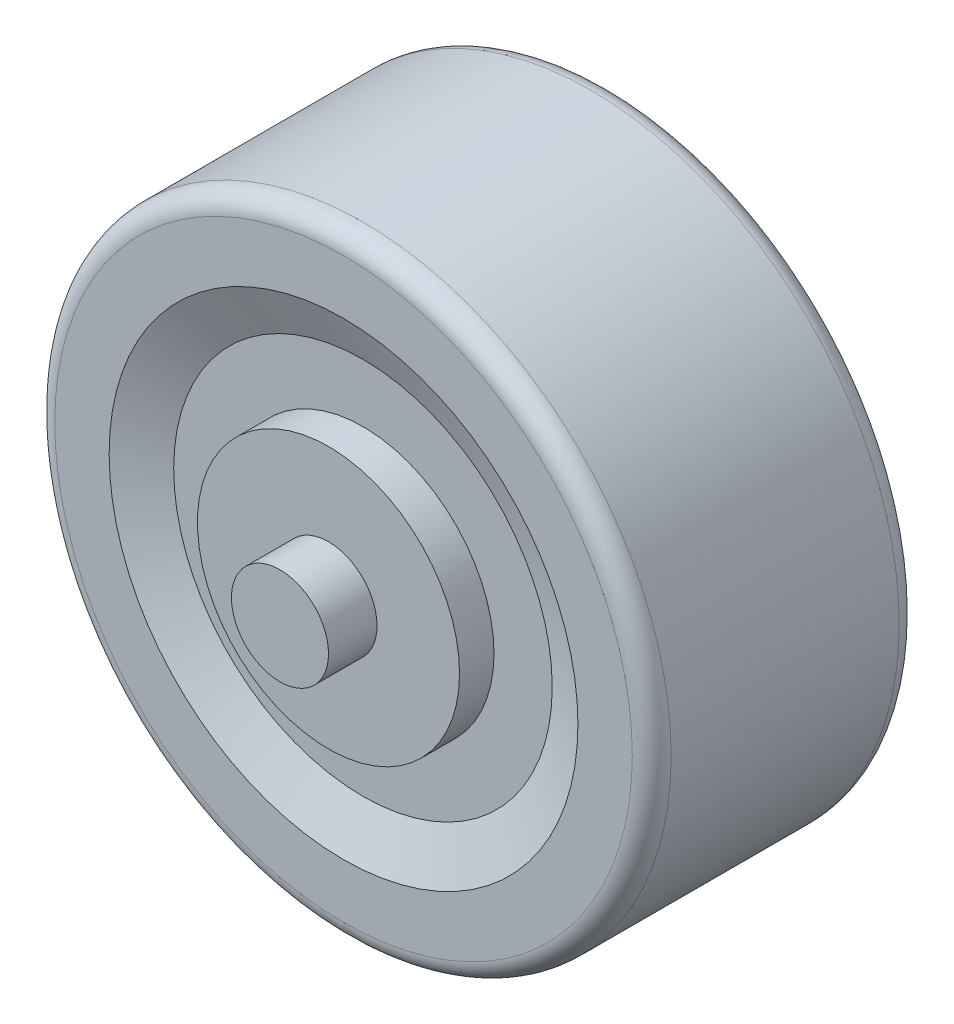
ISO-10303-21;
HEADER;
FILE_DESCRIPTION(('STEP AP214'),'2;1');
FILE_NAME('part.step','',(''),(''),'','','');
FILE_SCHEMA(('AUTOMOTIVE_DESIGN { 1 0 10303 214 1 1 1 1 }'));
ENDSEC;
DATA;
#1=APPLICATION_CONTEXT('core data for automotive mechanical design processes');
#2=APPLICATION_PROTOCOL_DEFINITION('international standard','automotive_design',2000,#1);
#3=PRODUCT_CONTEXT('',#1,'mechanical');
#4=PRODUCT('Part','Part','',(#3));
#5=PRODUCT_RELATED_PRODUCT_CATEGORY('part','',(#4));
#6=PRODUCT_DEFINITION_FORMATION('','',#4);
#7=PRODUCT_DEFINITION_CONTEXT('part definition',#1,'design');
#8=PRODUCT_DEFINITION('design','',#6,#7);
#9=PRODUCT_DEFINITION_SHAPE('','',#8);
#10=(LENGTH_UNIT() NAMED_UNIT(*) SI_UNIT(.MILLI.,.METRE.));
#11=(NAMED_UNIT(*) PLANE_ANGLE_UNIT() SI_UNIT($,.RADIAN.));
#12=(NAMED_UNIT(*) SI_UNIT($,.STERADIAN.) SOLID_ANGLE_UNIT());
#13=UNCERTAINTY_MEASURE_WITH_UNIT(LENGTH_MEASURE(1.E-05),#10,'distance_accuracy_value','');
#14=(GEOMETRIC_REPRESENTATION_CONTEXT(3) GLOBAL_UNCERTAINTY_ASSIGNED_CONTEXT((#13)) GLOBAL_UNIT_ASSIGNED_CONTEXT((#10,
#11,#12)) REPRESENTATION_CONTEXT('',''));
#15=CARTESIAN_POINT('',(0.,0.,0.));
#16=DIRECTION('',(0.,0.,1.));
#17=DIRECTION('',(1.,0.,0.));
#18=AXIS2_PLACEMENT_3D('',#15,#16,#17);
#19=CARTESIAN_POINT('',(2.5,0.,-10.15));
#20=DIRECTION('',(0.,0.,-1.));
#21=DIRECTION('',(-1.,0.,0.));
#22=AXIS2_PLACEMENT_3D('',#19,#20,#21);
#23=PLANE('',#22);
#24=CARTESIAN_POINT('',(0.,0.,-10.15));
#25=DIRECTION('',(0.,0.,1.));
#26=DIRECTION('',(1.,0.,0.));
#27=AXIS2_PLACEMENT_3D('',#24,#25,#26);
#28=CIRCLE('',#27,2.5);
#29=CARTESIAN_POINT('',(2.5,0.,-10.15));
#30=VERTEX_POINT('',#29);
#31=EDGE_CURVE('E56',#30,#30,#28,.T.);
#32=ORIENTED_EDGE('',*,*,#31,.F.);
#33=EDGE_LOOP('',(#32));
#34=FACE_BOUND('',#33,.T.);
#35=ADVANCED_FACE('F36',(#34),#23,.T.);
#36=CARTESIAN_POINT('',(0.,0.,0.));
#37=DIRECTION('',(0.,0.,1.));
#38=DIRECTION('',(1.,0.,0.));
#39=AXIS2_PLACEMENT_3D('',#36,#37,#38);
#40=CYLINDRICAL_SURFACE('',#39,2.5);
#41=ORIENTED_EDGE('',*,*,#31,.T.);
#42=EDGE_LOOP('',(#41));
#43=FACE_BOUND('',#42,.T.);
#44=CARTESIAN_POINT('',(0.,0.,-7.65));
#45=DIRECTION('',(0.,0.,1.));
#46=DIRECTION('',(1.,0.,0.));
#47=AXIS2_PLACEMENT_3D('',#44,#45,#46);
#48=CIRCLE('',#47,2.5);
#49=CARTESIAN_POINT('',(2.5,0.,-7.65));
#50=VERTEX_POINT('',#49);
#51=EDGE_CURVE('E59',#50,#50,#48,.T.);
#52=ORIENTED_EDGE('',*,*,#51,.F.);
#53=EDGE_LOOP('',(#52));
#54=FACE_BOUND('',#53,.T.);
#55=ADVANCED_FACE('F108',(#43,#54),#40,.T.);
#56=CARTESIAN_POINT('',(6.75,0.,-7.65));
#57=DIRECTION('',(0.,0.,-1.));
#58=DIRECTION('',(-1.,0.,0.));
#59=AXIS2_PLACEMENT_3D('',#56,#57,#58);
#60=PLANE('',#59);
#61=ORIENTED_EDGE('',*,*,#51,.T.);
#62=EDGE_LOOP('',(#61));
#63=FACE_BOUND('',#62,.T.);
#64=CARTESIAN_POINT('',(0.,0.,-7.65));
#65=DIRECTION('',(0.,0.,1.));
#66=DIRECTION('',(1.,0.,0.));
#67=AXIS2_PLACEMENT_3D('',#64,#65,#66);
#68=CIRCLE('',#67,6.75);
#69=CARTESIAN_POINT('',(6.75,0.,-7.65));
#70=VERTEX_POINT('',#69);
#71=EDGE_CURVE('E62',#70,#70,#68,.T.);
#72=ORIENTED_EDGE('',*,*,#71,.F.);
#73=EDGE_LOOP('',(#72));
#74=FACE_BOUND('',#73,.T.);
#75=ADVANCED_FACE('F114',(#63,#74),#60,.T.);
#76=CARTESIAN_POINT('',(0.,0.,0.));
#77=DIRECTION('',(0.,0.,1.));
#78=DIRECTION('',(1.,0.,0.));
#79=AXIS2_PLACEMENT_3D('',#76,#77,#78);
#80=CYLINDRICAL_SURFACE('',#79,6.75);
#81=ORIENTED_EDGE('',*,*,#71,.T.);
#82=EDGE_LOOP('',(#81));
#83=FACE_BOUND('',#82,.T.);
#84=CARTESIAN_POINT('',(0.,0.,-5.875));
#85=DIRECTION('',(0.,0.,1.));
#86=DIRECTION('',(1.,0.,0.));
#87=AXIS2_PLACEMENT_3D('',#84,#85,#86);
#88=CIRCLE('',#87,6.75);
#89=CARTESIAN_POINT('',(6.75,0.,-5.875));
#90=VERTEX_POINT('',#89);
#91=EDGE_CURVE('E65',#90,#90,#88,.T.);
#92=ORIENTED_EDGE('',*,*,#91,.F.);
#93=EDGE_LOOP('',(#92));
#94=FACE_BOUND('',#93,.T.);
#95=ADVANCED_FACE('F121',(#83,#94),#80,.T.);
#96=CARTESIAN_POINT('',(6.75,0.,-5.875));
#97=DIRECTION('',(0.,0.,-1.));
#98=DIRECTION('',(-1.,0.,0.));
#99=AXIS2_PLACEMENT_3D('',#96,#97,#98);
#100=PLANE('',#99);
#101=ORIENTED_EDGE('',*,*,#91,.T.);
#102=EDGE_LOOP('',(#101));
#103=FACE_BOUND('',#102,.T.);
#104=CARTESIAN_POINT('',(0.,0.,-5.875));
#105=DIRECTION('',(0.,0.,1.));
#106=DIRECTION('',(1.,0.,0.));
#107=AXIS2_PLACEMENT_3D('',#104,#105,#106);
#108=CIRCLE('',#107,9.75);
#109=CARTESIAN_POINT('',(9.75,0.,-5.875));
#110=VERTEX_POINT('',#109);
#111=EDGE_CURVE('E68',#110,#110,#108,.T.);
#112=ORIENTED_EDGE('',*,*,#111,.F.);
#113=EDGE_LOOP('',(#112));
#114=FACE_BOUND('',#113,.T.);
#115=ADVANCED_FACE('F125',(#103,#114),#100,.T.);
#116=CARTESIAN_POINT('',(0.,0.,-6.875));
#117=DIRECTION('',(0.,0.,-1.));
#118=DIRECTION('',(-1.,0.,0.));
#119=AXIS2_PLACEMENT_3D('',#116,#117,#118);
#120=CONICAL_SURFACE('',#119,12.075,1.1646075243759);
#121=ORIENTED_EDGE('',*,*,#111,.T.);
#122=EDGE_LOOP('',(#121));
#123=FACE_BOUND('',#122,.T.);
#124=CARTESIAN_POINT('',(0.,0.,-6.875));
#125=DIRECTION('',(0.,0.,1.));
#126=DIRECTION('',(1.,0.,0.));
#127=AXIS2_PLACEMENT_3D('',#124,#125,#126);
#128=CIRCLE('',#127,12.075);
#129=CARTESIAN_POINT('',(12.075,0.,-6.875));
#130=VERTEX_POINT('',#129);
#131=EDGE_CURVE('E71',#130,#130,#128,.T.);
#132=ORIENTED_EDGE('',*,*,#131,.F.);
#133=EDGE_LOOP('',(#132));
#134=FACE_BOUND('',#133,.T.);
#135=ADVANCED_FACE('F129',(#123,#134),#120,.F.);
#136=CARTESIAN_POINT('',(12.075,0.,-6.875));
#137=DIRECTION('',(0.,0.,-1.));
#138=DIRECTION('',(-1.,0.,0.));
#139=AXIS2_PLACEMENT_3D('',#136,#137,#138);
#140=PLANE('',#139);
#141=CARTESIAN_POINT('',(0.,0.,-6.875));
#142=DIRECTION('',(0.,0.,-1.));
#143=DIRECTION('',(-1.,0.,0.));
#144=AXIS2_PLACEMENT_3D('',#141,#142,#143);
#145=CIRCLE('',#144,14.875);
#146=CARTESIAN_POINT('',(-14.875,0.,-6.875));
#147=VERTEX_POINT('',#146);
#148=EDGE_CURVE('E43',#147,#147,#145,.T.);
#149=ORIENTED_EDGE('',*,*,#148,.T.);
#150=EDGE_LOOP('',(#149));
#151=FACE_BOUND('',#150,.T.);
#152=ORIENTED_EDGE('',*,*,#131,.T.);
#153=EDGE_LOOP('',(#152));
#154=FACE_BOUND('',#153,.T.);
#155=ADVANCED_FACE('F133',(#151,#154),#140,.T.);
#156=CARTESIAN_POINT('',(0.,0.,0.));
#157=DIRECTION('',(0.,0.,1.));
#158=DIRECTION('',(1.,0.,0.));
#159=AXIS2_PLACEMENT_3D('',#156,#157,#158);
#160=CYLINDRICAL_SURFACE('',#159,15.875);
#161=CARTESIAN_POINT('',(0.,0.,-5.875));
#162=DIRECTION('',(0.,0.,-1.));
#163=DIRECTION('',(-1.,0.,0.));
#164=AXIS2_PLACEMENT_3D('',#161,#162,#163);
#165=CIRCLE('',#164,15.875);
#166=CARTESIAN_POINT('',(-15.875,0.,-5.875));
#167=VERTEX_POINT('',#166);
#168=EDGE_CURVE('E47',#167,#167,#165,.F.);
#169=ORIENTED_EDGE('',*,*,#168,.T.);
#170=EDGE_LOOP('',(#169));
#171=FACE_BOUND('',#170,.T.);
#172=CARTESIAN_POINT('',(0.,0.,5.875));
#173=DIRECTION('',(0.,0.,1.));
#174=DIRECTION('',(1.,0.,0.));
#175=AXIS2_PLACEMENT_3D('',#172,#173,#174);
#176=CIRCLE('',#175,15.875);
#177=CARTESIAN_POINT('',(15.875,0.,5.875));
#178=VERTEX_POINT('',#177);
#179=EDGE_CURVE('E51',#178,#178,#176,.F.);
#180=ORIENTED_EDGE('',*,*,#179,.T.);
#181=EDGE_LOOP('',(#180));
#182=FACE_BOUND('',#181,.T.);
#183=ADVANCED_FACE('F137',(#171,#182),#160,.T.);
#184=CARTESIAN_POINT('',(2.5,0.,10.15));
#185=DIRECTION('',(0.,0.,1.));
#186=DIRECTION('',(-1.,0.,0.));
#187=AXIS2_PLACEMENT_3D('',#184,#185,#186);
#188=PLANE('',#187);
#189=CARTESIAN_POINT('',(0.,0.,10.15));
#190=DIRECTION('',(0.,0.,1.));
#191=DIRECTION('',(1.,0.,0.));
#192=AXIS2_PLACEMENT_3D('',#189,#190,#191);
#193=CIRCLE('',#192,2.5);
#194=CARTESIAN_POINT('',(2.5,0.,10.15));
#195=VERTEX_POINT('',#194);
#196=EDGE_CURVE('E74',#195,#195,#193,.T.);
#197=ORIENTED_EDGE('',*,*,#196,.T.);
#198=EDGE_LOOP('',(#197));
#199=FACE_BOUND('',#198,.T.);
#200=ADVANCED_FACE('F140',(#199),#188,.T.);
#201=CARTESIAN_POINT('',(0.,0.,0.));
#202=DIRECTION('',(0.,0.,-1.));
#203=DIRECTION('',(1.,0.,0.));
#204=AXIS2_PLACEMENT_3D('',#201,#202,#203);
#205=CYLINDRICAL_SURFACE('',#204,2.5);
#206=ORIENTED_EDGE('',*,*,#196,.F.);
#207=EDGE_LOOP('',(#206));
#208=FACE_BOUND('',#207,.T.);
#209=CARTESIAN_POINT('',(0.,0.,7.65));
#210=DIRECTION('',(0.,0.,1.));
#211=DIRECTION('',(1.,0.,0.));
#212=AXIS2_PLACEMENT_3D('',#209,#210,#211);
#213=CIRCLE('',#212,2.5);
#214=CARTESIAN_POINT('',(2.5,0.,7.65));
#215=VERTEX_POINT('',#214);
#216=EDGE_CURVE('E77',#215,#215,#213,.T.);
#217=ORIENTED_EDGE('',*,*,#216,.T.);
#218=EDGE_LOOP('',(#217));
#219=FACE_BOUND('',#218,.T.);
#220=ADVANCED_FACE('F144',(#208,#219),#205,.T.);
#221=CARTESIAN_POINT('',(6.75,0.,7.65));
#222=DIRECTION('',(0.,0.,1.));
#223=DIRECTION('',(-1.,0.,0.));
#224=AXIS2_PLACEMENT_3D('',#221,#222,#223);
#225=PLANE('',#224);
#226=ORIENTED_EDGE('',*,*,#216,.F.);
#227=EDGE_LOOP('',(#226));
#228=FACE_BOUND('',#227,.T.);
#229=CARTESIAN_POINT('',(0.,0.,7.65));
#230=DIRECTION('',(0.,0.,1.));
#231=DIRECTION('',(1.,0.,0.));
#232=AXIS2_PLACEMENT_3D('',#229,#230,#231);
#233=CIRCLE('',#232,6.75);
#234=CARTESIAN_POINT('',(6.75,0.,7.65));
#235=VERTEX_POINT('',#234);
#236=EDGE_CURVE('E80',#235,#235,#233,.T.);
#237=ORIENTED_EDGE('',*,*,#236,.T.);
#238=EDGE_LOOP('',(#237));
#239=FACE_BOUND('',#238,.T.);
#240=ADVANCED_FACE('F148',(#228,#239),#225,.T.);
#241=CARTESIAN_POINT('',(0.,0.,0.));
#242=DIRECTION('',(0.,0.,-1.));
#243=DIRECTION('',(1.,0.,0.));
#244=AXIS2_PLACEMENT_3D('',#241,#242,#243);
#245=CYLINDRICAL_SURFACE('',#244,6.75);
#246=ORIENTED_EDGE('',*,*,#236,.F.);
#247=EDGE_LOOP('',(#246));
#248=FACE_BOUND('',#247,.T.);
#249=CARTESIAN_POINT('',(0.,0.,5.875));
#250=DIRECTION('',(0.,0.,1.));
#251=DIRECTION('',(1.,0.,0.));
#252=AXIS2_PLACEMENT_3D('',#249,#250,#251);
#253=CIRCLE('',#252,6.75);
#254=CARTESIAN_POINT('',(6.75,0.,5.875));
#255=VERTEX_POINT('',#254);
#256=EDGE_CURVE('E83',#255,#255,#253,.T.);
#257=ORIENTED_EDGE('',*,*,#256,.T.);
#258=EDGE_LOOP('',(#257));
#259=FACE_BOUND('',#258,.T.);
#260=ADVANCED_FACE('F152',(#248,#259),#245,.T.);
#261=CARTESIAN_POINT('',(6.75,0.,5.875));
#262=DIRECTION('',(0.,0.,1.));
#263=DIRECTION('',(-1.,0.,0.));
#264=AXIS2_PLACEMENT_3D('',#261,#262,#263);
#265=PLANE('',#264);
#266=ORIENTED_EDGE('',*,*,#256,.F.);
#267=EDGE_LOOP('',(#266));
#268=FACE_BOUND('',#267,.T.);
#269=CARTESIAN_POINT('',(0.,0.,5.875));
#270=DIRECTION('',(0.,0.,1.));
#271=DIRECTION('',(1.,0.,0.));
#272=AXIS2_PLACEMENT_3D('',#269,#270,#271);
#273=CIRCLE('',#272,9.75);
#274=CARTESIAN_POINT('',(9.75,0.,5.875));
#275=VERTEX_POINT('',#274);
#276=EDGE_CURVE('E86',#275,#275,#273,.T.);
#277=ORIENTED_EDGE('',*,*,#276,.T.);
#278=EDGE_LOOP('',(#277));
#279=FACE_BOUND('',#278,.T.);
#280=ADVANCED_FACE('F104',(#268,#279),#265,.T.);
#281=CARTESIAN_POINT('',(0.,0.,6.875));
#282=DIRECTION('',(0.,0.,1.));
#283=DIRECTION('',(-1.,0.,0.));
#284=AXIS2_PLACEMENT_3D('',#281,#282,#283);
#285=CONICAL_SURFACE('',#284,12.075,1.1646075243759);
#286=ORIENTED_EDGE('',*,*,#276,.F.);
#287=EDGE_LOOP('',(#286));
#288=FACE_BOUND('',#287,.T.);
#289=CARTESIAN_POINT('',(0.,0.,6.875));
#290=DIRECTION('',(0.,0.,1.));
#291=DIRECTION('',(1.,0.,0.));
#292=AXIS2_PLACEMENT_3D('',#289,#290,#291);
#293=CIRCLE('',#292,12.075);
#294=CARTESIAN_POINT('',(12.075,0.,6.875));
#295=VERTEX_POINT('',#294);
#296=EDGE_CURVE('E89',#295,#295,#293,.T.);
#297=ORIENTED_EDGE('',*,*,#296,.T.);
#298=EDGE_LOOP('',(#297));
#299=FACE_BOUND('',#298,.T.);
#300=ADVANCED_FACE('F93',(#288,#299),#285,.F.);
#301=CARTESIAN_POINT('',(12.075,0.,6.875));
#302=DIRECTION('',(0.,0.,1.));
#303=DIRECTION('',(-1.,0.,0.));
#304=AXIS2_PLACEMENT_3D('',#301,#302,#303);
#305=PLANE('',#304);
#306=CARTESIAN_POINT('',(0.,0.,6.875));
#307=DIRECTION('',(0.,0.,1.));
#308=DIRECTION('',(1.,0.,0.));
#309=AXIS2_PLACEMENT_3D('',#306,#307,#308);
#310=CIRCLE('',#309,14.875);
#311=CARTESIAN_POINT('',(14.875,0.,6.875));
#312=VERTEX_POINT('',#311);
#313=EDGE_CURVE('E10',#312,#312,#310,.T.);
#314=ORIENTED_EDGE('',*,*,#313,.T.);
#315=EDGE_LOOP('',(#314));
#316=FACE_BOUND('',#315,.T.);
#317=ORIENTED_EDGE('',*,*,#296,.F.);
#318=EDGE_LOOP('',(#317));
#319=FACE_BOUND('',#318,.T.);
#320=ADVANCED_FACE('F95',(#316,#319),#305,.T.);
#321=CARTESIAN_POINT('',(0.,0.,-5.875));
#322=DIRECTION('',(0.,0.,-1.));
#323=DIRECTION('',(-1.,0.,0.));
#324=AXIS2_PLACEMENT_3D('',#321,#322,#323);
#325=TOROIDAL_SURFACE('',#324,14.875,1.);
#326=ORIENTED_EDGE('',*,*,#148,.F.);
#327=EDGE_LOOP('',(#326));
#328=FACE_BOUND('',#327,.T.);
#329=ORIENTED_EDGE('',*,*,#168,.F.);
#330=EDGE_LOOP('',(#329));
#331=FACE_BOUND('',#330,.T.);
#332=ADVANCED_FACE('F97',(#328,#331),#325,.T.);
#333=CARTESIAN_POINT('',(0.,0.,5.875));
#334=DIRECTION('',(0.,0.,1.));
#335=DIRECTION('',(1.,0.,0.));
#336=AXIS2_PLACEMENT_3D('',#333,#334,#335);
#337=TOROIDAL_SURFACE('',#336,14.875,1.);
#338=ORIENTED_EDGE('',*,*,#179,.F.);
#339=EDGE_LOOP('',(#338));
#340=FACE_BOUND('',#339,.T.);
#341=ORIENTED_EDGE('',*,*,#313,.F.);
#342=EDGE_LOOP('',(#341));
#343=FACE_BOUND('',#342,.T.);
#344=ADVANCED_FACE('F38',(#340,#343),#337,.T.);
#345=CLOSED_SHELL('',(#35,#55,#75,#95,#115,#135,#155,#183,#200,#220,#240,#260,#280,#300,#320,
#332,#344));
#346=MANIFOLD_SOLID_BREP('B2',#345);
#347=ADVANCED_BREP_SHAPE_REPRESENTATION('',(#18,#346),#14);
#348=SHAPE_DEFINITION_REPRESENTATION(#9,#347);
ENDSEC;
END-ISO-10303-21;
